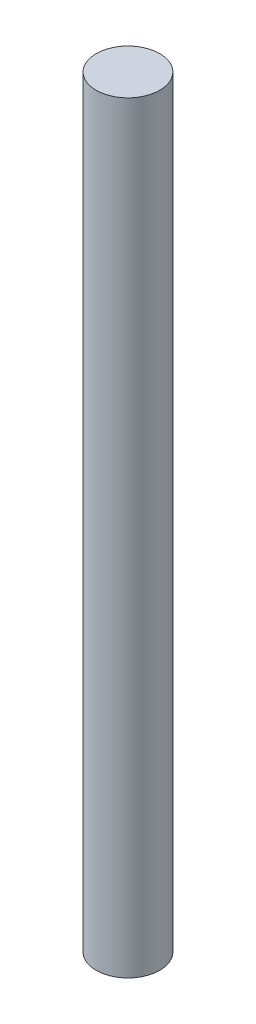
ISO-10303-21;
HEADER;
FILE_DESCRIPTION(('STEP AP214'),'2;1');
FILE_NAME('part.step','',(''),(''),'','','');
FILE_SCHEMA(('AUTOMOTIVE_DESIGN { 1 0 10303 214 1 1 1 1 }'));
ENDSEC;
DATA;
#1=APPLICATION_CONTEXT('core data for automotive mechanical design processes');
#2=APPLICATION_PROTOCOL_DEFINITION('international standard','automotive_design',2000,#1);
#3=PRODUCT_CONTEXT('',#1,'mechanical');
#4=PRODUCT('Part','Part','',(#3));
#5=PRODUCT_RELATED_PRODUCT_CATEGORY('part','',(#4));
#6=PRODUCT_DEFINITION_FORMATION('','',#4);
#7=PRODUCT_DEFINITION_CONTEXT('part definition',#1,'design');
#8=PRODUCT_DEFINITION('design','',#6,#7);
#9=PRODUCT_DEFINITION_SHAPE('','',#8);
#10=(LENGTH_UNIT() NAMED_UNIT(*) SI_UNIT(.MILLI.,.METRE.));
#11=(NAMED_UNIT(*) PLANE_ANGLE_UNIT() SI_UNIT($,.RADIAN.));
#12=(NAMED_UNIT(*) SI_UNIT($,.STERADIAN.) SOLID_ANGLE_UNIT());
#13=UNCERTAINTY_MEASURE_WITH_UNIT(LENGTH_MEASURE(1.E-05),#10,'distance_accuracy_value','');
#14=(GEOMETRIC_REPRESENTATION_CONTEXT(3) GLOBAL_UNCERTAINTY_ASSIGNED_CONTEXT((#13)) GLOBAL_UNIT_ASSIGNED_CONTEXT((#10,
#11,#12)) REPRESENTATION_CONTEXT('',''));
#15=CARTESIAN_POINT('',(0.,0.,0.));
#16=DIRECTION('',(0.,0.,1.));
#17=DIRECTION('',(1.,0.,0.));
#18=AXIS2_PLACEMENT_3D('',#15,#16,#17);
#19=CARTESIAN_POINT('',(0.,120.,0.));
#20=DIRECTION('',(0.,-1.,0.));
#21=DIRECTION('',(0.,0.,-1.));
#22=AXIS2_PLACEMENT_3D('',#19,#20,#21);
#23=CYLINDRICAL_SURFACE('',#22,5.);
#24=CARTESIAN_POINT('',(0.,120.,0.));
#25=DIRECTION('',(0.,1.,0.));
#26=DIRECTION('',(0.,0.,1.));
#27=AXIS2_PLACEMENT_3D('',#24,#25,#26);
#28=CIRCLE('',#27,5.);
#29=CARTESIAN_POINT('',(0.,120.,5.));
#30=VERTEX_POINT('',#29);
#31=EDGE_CURVE('E10',#30,#30,#28,.T.);
#32=ORIENTED_EDGE('',*,*,#31,.F.);
#33=EDGE_LOOP('',(#32));
#34=FACE_BOUND('',#33,.T.);
#35=CARTESIAN_POINT('',(0.,0.,0.));
#36=DIRECTION('',(0.,1.,0.));
#37=DIRECTION('',(0.,0.,1.));
#38=AXIS2_PLACEMENT_3D('',#35,#36,#37);
#39=CIRCLE('',#38,5.);
#40=CARTESIAN_POINT('',(0.,0.,5.));
#41=VERTEX_POINT('',#40);
#42=EDGE_CURVE('E45',#41,#41,#39,.T.);
#43=ORIENTED_EDGE('',*,*,#42,.T.);
#44=EDGE_LOOP('',(#43));
#45=FACE_BOUND('',#44,.T.);
#46=ADVANCED_FACE('F42',(#34,#45),#23,.T.);
#47=CARTESIAN_POINT('',(0.,120.,0.));
#48=DIRECTION('',(0.,1.,0.));
#49=DIRECTION('',(0.,0.,1.));
#50=AXIS2_PLACEMENT_3D('',#47,#48,#49);
#51=PLANE('',#50);
#52=ORIENTED_EDGE('',*,*,#31,.T.);
#53=EDGE_LOOP('',(#52));
#54=FACE_BOUND('',#53,.T.);
#55=ADVANCED_FACE('F57',(#54),#51,.T.);
#56=CARTESIAN_POINT('',(0.,0.,0.));
#57=DIRECTION('',(0.,1.,0.));
#58=DIRECTION('',(0.,0.,1.));
#59=AXIS2_PLACEMENT_3D('',#56,#57,#58);
#60=PLANE('',#59);
#61=ORIENTED_EDGE('',*,*,#42,.F.);
#62=EDGE_LOOP('',(#61));
#63=FACE_BOUND('',#62,.T.);
#64=ADVANCED_FACE('F55',(#63),#60,.F.);
#65=CLOSED_SHELL('',(#46,#55,#64));
#66=MANIFOLD_SOLID_BREP('B2',#65);
#67=ADVANCED_BREP_SHAPE_REPRESENTATION('',(#18,#66),#14);
#68=SHAPE_DEFINITION_REPRESENTATION(#9,#67);
ENDSEC;
END-ISO-10303-21;
